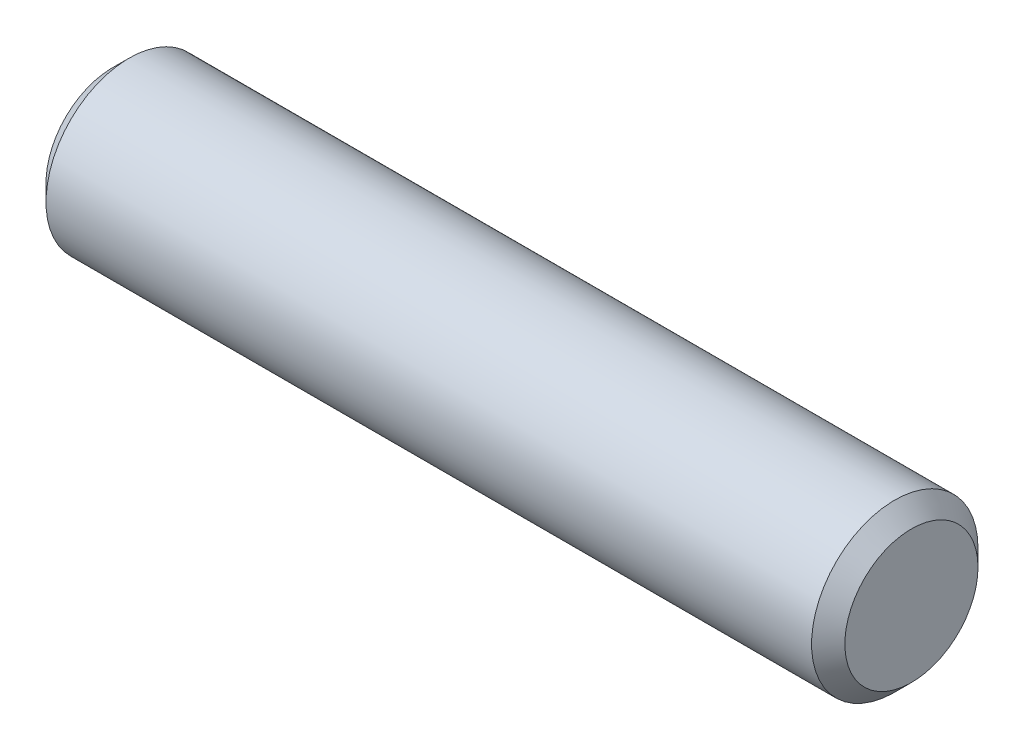
ISO-10303-21;
HEADER;
FILE_DESCRIPTION(('STEP AP214'),'2;1');
FILE_NAME('part.step','',(''),(''),'','','');
FILE_SCHEMA(('AUTOMOTIVE_DESIGN { 1 0 10303 214 1 1 1 1 }'));
ENDSEC;
DATA;
#1=APPLICATION_CONTEXT('core data for automotive mechanical design processes');
#2=APPLICATION_PROTOCOL_DEFINITION('international standard','automotive_design',2000,#1);
#3=PRODUCT_CONTEXT('',#1,'mechanical');
#4=PRODUCT('Part','Part','',(#3));
#5=PRODUCT_RELATED_PRODUCT_CATEGORY('part','',(#4));
#6=PRODUCT_DEFINITION_FORMATION('','',#4);
#7=PRODUCT_DEFINITION_CONTEXT('part definition',#1,'design');
#8=PRODUCT_DEFINITION('design','',#6,#7);
#9=PRODUCT_DEFINITION_SHAPE('','',#8);
#10=(LENGTH_UNIT() NAMED_UNIT(*) SI_UNIT(.MILLI.,.METRE.));
#11=(NAMED_UNIT(*) PLANE_ANGLE_UNIT() SI_UNIT($,.RADIAN.));
#12=(NAMED_UNIT(*) SI_UNIT($,.STERADIAN.) SOLID_ANGLE_UNIT());
#13=UNCERTAINTY_MEASURE_WITH_UNIT(LENGTH_MEASURE(1.E-05),#10,'distance_accuracy_value','');
#14=(GEOMETRIC_REPRESENTATION_CONTEXT(3) GLOBAL_UNCERTAINTY_ASSIGNED_CONTEXT((#13)) GLOBAL_UNIT_ASSIGNED_CONTEXT((#10,
#11,#12)) REPRESENTATION_CONTEXT('',''));
#15=CARTESIAN_POINT('',(0.,0.,0.));
#16=DIRECTION('',(0.,0.,1.));
#17=DIRECTION('',(1.,0.,0.));
#18=AXIS2_PLACEMENT_3D('',#15,#16,#17);
#19=CARTESIAN_POINT('',(-19.05,0.,0.));
#20=DIRECTION('',(1.,0.,0.));
#21=DIRECTION('',(0.,0.,-1.));
#22=AXIS2_PLACEMENT_3D('',#19,#20,#21);
#23=CYLINDRICAL_SURFACE('',#22,3.96875);
#24=CARTESIAN_POINT('',(18.25625,0.,0.));
#25=DIRECTION('',(1.,0.,0.));
#26=DIRECTION('',(0.,0.,-1.));
#27=AXIS2_PLACEMENT_3D('',#24,#25,#26);
#28=CIRCLE('',#27,3.96875);
#29=CARTESIAN_POINT('',(18.25625,0.,-3.96875));
#30=VERTEX_POINT('',#29);
#31=EDGE_CURVE('E46',#30,#30,#28,.F.);
#32=ORIENTED_EDGE('',*,*,#31,.T.);
#33=EDGE_LOOP('',(#32));
#34=FACE_BOUND('',#33,.T.);
#35=CARTESIAN_POINT('',(-18.25625,0.,0.));
#36=DIRECTION('',(1.,0.,0.));
#37=DIRECTION('',(0.,0.,-1.));
#38=AXIS2_PLACEMENT_3D('',#35,#36,#37);
#39=CIRCLE('',#38,3.96875);
#40=CARTESIAN_POINT('',(-18.25625,0.,-3.96875));
#41=VERTEX_POINT('',#40);
#42=EDGE_CURVE('E50',#41,#41,#39,.T.);
#43=ORIENTED_EDGE('',*,*,#42,.T.);
#44=EDGE_LOOP('',(#43));
#45=FACE_BOUND('',#44,.T.);
#46=ADVANCED_FACE('F39',(#34,#45),#23,.T.);
#47=CARTESIAN_POINT('',(-19.05,0.,0.));
#48=DIRECTION('',(1.,0.,0.));
#49=DIRECTION('',(0.,0.,-1.));
#50=AXIS2_PLACEMENT_3D('',#47,#48,#49);
#51=PLANE('',#50);
#52=CARTESIAN_POINT('',(-19.05,0.,0.));
#53=DIRECTION('',(1.,0.,0.));
#54=DIRECTION('',(0.,0.,-1.));
#55=AXIS2_PLACEMENT_3D('',#52,#53,#54);
#56=CIRCLE('',#55,3.17499999999999);
#57=CARTESIAN_POINT('',(-19.05,0.,-3.17499999999999));
#58=VERTEX_POINT('',#57);
#59=EDGE_CURVE('E10',#58,#58,#56,.F.);
#60=ORIENTED_EDGE('',*,*,#59,.T.);
#61=EDGE_LOOP('',(#60));
#62=FACE_BOUND('',#61,.T.);
#63=ADVANCED_FACE('F70',(#62),#51,.F.);
#64=CARTESIAN_POINT('',(19.05,0.,0.));
#65=DIRECTION('',(1.,0.,0.));
#66=DIRECTION('',(0.,0.,-1.));
#67=AXIS2_PLACEMENT_3D('',#64,#65,#66);
#68=PLANE('',#67);
#69=CARTESIAN_POINT('',(19.05,0.,0.));
#70=DIRECTION('',(1.,0.,0.));
#71=DIRECTION('',(0.,0.,-1.));
#72=AXIS2_PLACEMENT_3D('',#69,#70,#71);
#73=CIRCLE('',#72,3.17499999999999);
#74=CARTESIAN_POINT('',(19.05,0.,-3.17499999999999));
#75=VERTEX_POINT('',#74);
#76=EDGE_CURVE('E54',#75,#75,#73,.T.);
#77=ORIENTED_EDGE('',*,*,#76,.T.);
#78=EDGE_LOOP('',(#77));
#79=FACE_BOUND('',#78,.T.);
#80=ADVANCED_FACE('F60',(#79),#68,.T.);
#81=CARTESIAN_POINT('',(19.05,0.,0.));
#82=DIRECTION('',(-1.,0.,0.));
#83=DIRECTION('',(0.,0.,1.));
#84=AXIS2_PLACEMENT_3D('',#81,#82,#83);
#85=CONICAL_SURFACE('',#84,3.17499999999999,0.78539816339745);
#86=ORIENTED_EDGE('',*,*,#31,.F.);
#87=EDGE_LOOP('',(#86));
#88=FACE_BOUND('',#87,.T.);
#89=ORIENTED_EDGE('',*,*,#76,.F.);
#90=EDGE_LOOP('',(#89));
#91=FACE_BOUND('',#90,.T.);
#92=ADVANCED_FACE('F62',(#88,#91),#85,.T.);
#93=CARTESIAN_POINT('',(-18.25625,0.,0.));
#94=DIRECTION('',(1.,0.,0.));
#95=DIRECTION('',(0.,0.,-1.));
#96=AXIS2_PLACEMENT_3D('',#93,#94,#95);
#97=CONICAL_SURFACE('',#96,3.96875,0.78539816339745);
#98=ORIENTED_EDGE('',*,*,#59,.F.);
#99=EDGE_LOOP('',(#98));
#100=FACE_BOUND('',#99,.T.);
#101=ORIENTED_EDGE('',*,*,#42,.F.);
#102=EDGE_LOOP('',(#101));
#103=FACE_BOUND('',#102,.T.);
#104=ADVANCED_FACE('F41',(#100,#103),#97,.T.);
#105=CLOSED_SHELL('',(#46,#63,#80,#92,#104));
#106=MANIFOLD_SOLID_BREP('B2',#105);
#107=ADVANCED_BREP_SHAPE_REPRESENTATION('',(#18,#106),#14);
#108=SHAPE_DEFINITION_REPRESENTATION(#9,#107);
ENDSEC;
END-ISO-10303-21;
